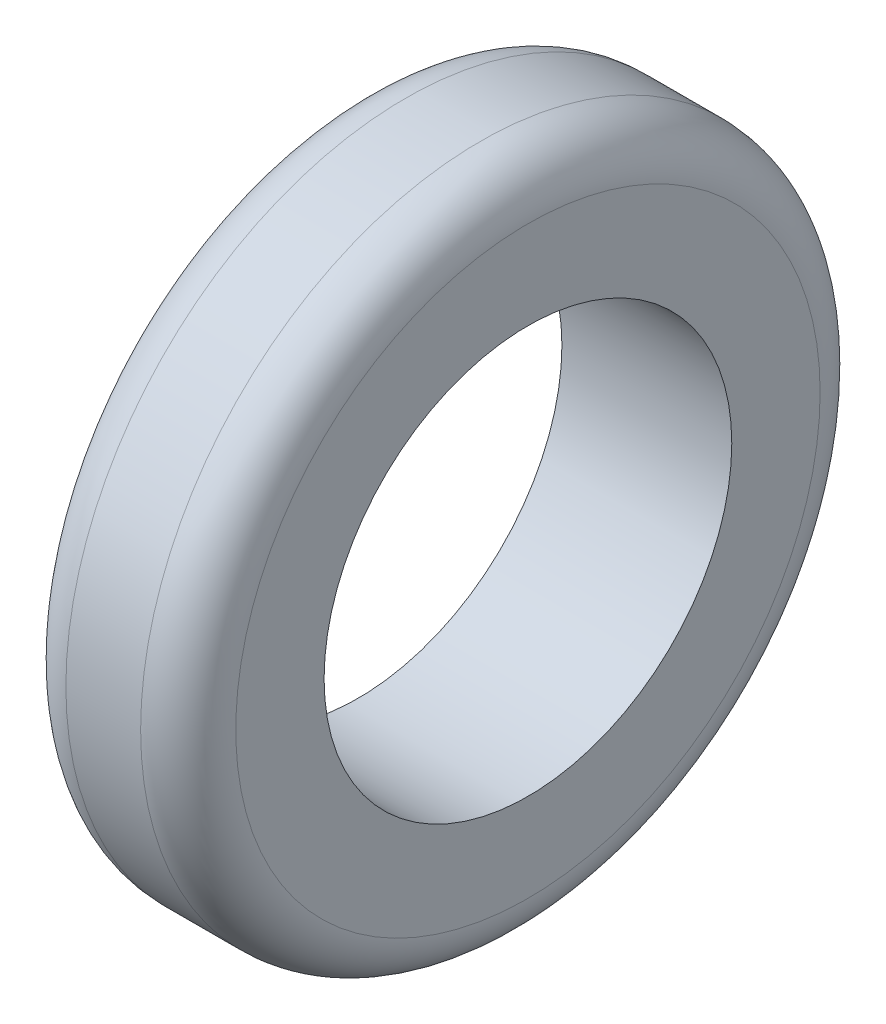
ISO-10303-21;
HEADER;
FILE_DESCRIPTION(('STEP AP214'),'2;1');
FILE_NAME('part.step','',(''),(''),'','','');
FILE_SCHEMA(('AUTOMOTIVE_DESIGN { 1 0 10303 214 1 1 1 1 }'));
ENDSEC;
DATA;
#1=APPLICATION_CONTEXT('core data for automotive mechanical design processes');
#2=APPLICATION_PROTOCOL_DEFINITION('international standard','automotive_design',2000,#1);
#3=PRODUCT_CONTEXT('',#1,'mechanical');
#4=PRODUCT('Part','Part','',(#3));
#5=PRODUCT_RELATED_PRODUCT_CATEGORY('part','',(#4));
#6=PRODUCT_DEFINITION_FORMATION('','',#4);
#7=PRODUCT_DEFINITION_CONTEXT('part definition',#1,'design');
#8=PRODUCT_DEFINITION('design','',#6,#7);
#9=PRODUCT_DEFINITION_SHAPE('','',#8);
#10=(LENGTH_UNIT() NAMED_UNIT(*) SI_UNIT(.MILLI.,.METRE.));
#11=(NAMED_UNIT(*) PLANE_ANGLE_UNIT() SI_UNIT($,.RADIAN.));
#12=(NAMED_UNIT(*) SI_UNIT($,.STERADIAN.) SOLID_ANGLE_UNIT());
#13=UNCERTAINTY_MEASURE_WITH_UNIT(LENGTH_MEASURE(1.E-05),#10,'distance_accuracy_value','');
#14=(GEOMETRIC_REPRESENTATION_CONTEXT(3) GLOBAL_UNCERTAINTY_ASSIGNED_CONTEXT((#13)) GLOBAL_UNIT_ASSIGNED_CONTEXT((#10,
#11,#12)) REPRESENTATION_CONTEXT('',''));
#15=CARTESIAN_POINT('',(0.,0.,0.));
#16=DIRECTION('',(0.,0.,1.));
#17=DIRECTION('',(1.,0.,0.));
#18=AXIS2_PLACEMENT_3D('',#15,#16,#17);
#19=CARTESIAN_POINT('',(25.,0.,0.));
#20=DIRECTION('',(1.,0.,0.));
#21=DIRECTION('',(0.,0.,-1.));
#22=AXIS2_PLACEMENT_3D('',#19,#20,#21);
#23=PLANE('',#22);
#24=CARTESIAN_POINT('',(25.,0.,0.));
#25=DIRECTION('',(1.,0.,0.));
#26=DIRECTION('',(0.,0.,-1.));
#27=AXIS2_PLACEMENT_3D('',#24,#25,#26);
#28=CIRCLE('',#27,43.);
#29=CARTESIAN_POINT('',(25.,0.,-43.));
#30=VERTEX_POINT('',#29);
#31=EDGE_CURVE('E10',#30,#30,#28,.T.);
#32=ORIENTED_EDGE('',*,*,#31,.T.);
#33=EDGE_LOOP('',(#32));
#34=FACE_BOUND('',#33,.T.);
#35=CARTESIAN_POINT('',(25.,0.,0.));
#36=DIRECTION('',(1.,0.,0.));
#37=DIRECTION('',(0.,0.,-1.));
#38=AXIS2_PLACEMENT_3D('',#35,#36,#37);
#39=CIRCLE('',#38,30.);
#40=CARTESIAN_POINT('',(25.,0.,-30.));
#41=VERTEX_POINT('',#40);
#42=EDGE_CURVE('E53',#41,#41,#39,.T.);
#43=ORIENTED_EDGE('',*,*,#42,.F.);
#44=EDGE_LOOP('',(#43));
#45=FACE_BOUND('',#44,.T.);
#46=ADVANCED_FACE('F33',(#34,#45),#23,.T.);
#47=CARTESIAN_POINT('',(0.,0.,0.));
#48=DIRECTION('',(1.,0.,0.));
#49=DIRECTION('',(0.,0.,-1.));
#50=AXIS2_PLACEMENT_3D('',#47,#48,#49);
#51=PLANE('',#50);
#52=CARTESIAN_POINT('',(0.,0.,0.));
#53=DIRECTION('',(1.,0.,0.));
#54=DIRECTION('',(0.,0.,-1.));
#55=AXIS2_PLACEMENT_3D('',#52,#53,#54);
#56=CIRCLE('',#55,43.);
#57=CARTESIAN_POINT('',(0.,0.,-43.));
#58=VERTEX_POINT('',#57);
#59=EDGE_CURVE('E40',#58,#58,#56,.F.);
#60=ORIENTED_EDGE('',*,*,#59,.T.);
#61=EDGE_LOOP('',(#60));
#62=FACE_BOUND('',#61,.T.);
#63=CARTESIAN_POINT('',(0.,0.,0.));
#64=DIRECTION('',(1.,0.,0.));
#65=DIRECTION('',(0.,0.,-1.));
#66=AXIS2_PLACEMENT_3D('',#63,#64,#65);
#67=CIRCLE('',#66,30.);
#68=CARTESIAN_POINT('',(0.,0.,-30.));
#69=VERTEX_POINT('',#68);
#70=EDGE_CURVE('E54',#69,#69,#67,.T.);
#71=ORIENTED_EDGE('',*,*,#70,.T.);
#72=EDGE_LOOP('',(#71));
#73=FACE_BOUND('',#72,.T.);
#74=ADVANCED_FACE('F64',(#62,#73),#51,.F.);
#75=CARTESIAN_POINT('',(25.,0.,0.));
#76=DIRECTION('',(-1.,0.,0.));
#77=DIRECTION('',(0.,0.,1.));
#78=AXIS2_PLACEMENT_3D('',#75,#76,#77);
#79=CYLINDRICAL_SURFACE('',#78,50.);
#80=CARTESIAN_POINT('',(7.,0.,0.));
#81=DIRECTION('',(1.,0.,0.));
#82=DIRECTION('',(0.,0.,-1.));
#83=AXIS2_PLACEMENT_3D('',#80,#81,#82);
#84=CIRCLE('',#83,50.);
#85=CARTESIAN_POINT('',(7.,0.,-50.));
#86=VERTEX_POINT('',#85);
#87=EDGE_CURVE('E44',#86,#86,#84,.T.);
#88=ORIENTED_EDGE('',*,*,#87,.T.);
#89=EDGE_LOOP('',(#88));
#90=FACE_BOUND('',#89,.T.);
#91=CARTESIAN_POINT('',(18.,0.,0.));
#92=DIRECTION('',(1.,0.,0.));
#93=DIRECTION('',(0.,0.,-1.));
#94=AXIS2_PLACEMENT_3D('',#91,#92,#93);
#95=CIRCLE('',#94,50.);
#96=CARTESIAN_POINT('',(18.,0.,-50.));
#97=VERTEX_POINT('',#96);
#98=EDGE_CURVE('E48',#97,#97,#95,.F.);
#99=ORIENTED_EDGE('',*,*,#98,.T.);
#100=EDGE_LOOP('',(#99));
#101=FACE_BOUND('',#100,.T.);
#102=ADVANCED_FACE('F69',(#90,#101),#79,.T.);
#103=CARTESIAN_POINT('',(25.,0.,0.));
#104=DIRECTION('',(-1.,0.,0.));
#105=DIRECTION('',(0.,0.,1.));
#106=AXIS2_PLACEMENT_3D('',#103,#104,#105);
#107=CYLINDRICAL_SURFACE('',#106,30.);
#108=ORIENTED_EDGE('',*,*,#42,.T.);
#109=EDGE_LOOP('',(#108));
#110=FACE_BOUND('',#109,.T.);
#111=ORIENTED_EDGE('',*,*,#70,.F.);
#112=EDGE_LOOP('',(#111));
#113=FACE_BOUND('',#112,.T.);
#114=ADVANCED_FACE('F60',(#110,#113),#107,.F.);
#115=CARTESIAN_POINT('',(7.,0.,0.));
#116=DIRECTION('',(1.,0.,0.));
#117=DIRECTION('',(0.,0.,-1.));
#118=AXIS2_PLACEMENT_3D('',#115,#116,#117);
#119=TOROIDAL_SURFACE('',#118,43.,7.);
#120=ORIENTED_EDGE('',*,*,#59,.F.);
#121=EDGE_LOOP('',(#120));
#122=FACE_BOUND('',#121,.T.);
#123=ORIENTED_EDGE('',*,*,#87,.F.);
#124=EDGE_LOOP('',(#123));
#125=FACE_BOUND('',#124,.T.);
#126=ADVANCED_FACE('F75',(#122,#125),#119,.T.);
#127=CARTESIAN_POINT('',(18.,0.,0.));
#128=DIRECTION('',(1.,0.,0.));
#129=DIRECTION('',(0.,0.,-1.));
#130=AXIS2_PLACEMENT_3D('',#127,#128,#129);
#131=TOROIDAL_SURFACE('',#130,43.,7.);
#132=ORIENTED_EDGE('',*,*,#98,.F.);
#133=EDGE_LOOP('',(#132));
#134=FACE_BOUND('',#133,.T.);
#135=ORIENTED_EDGE('',*,*,#31,.F.);
#136=EDGE_LOOP('',(#135));
#137=FACE_BOUND('',#136,.T.);
#138=ADVANCED_FACE('F35',(#134,#137),#131,.T.);
#139=CLOSED_SHELL('',(#46,#74,#102,#114,#126,#138));
#140=MANIFOLD_SOLID_BREP('B2',#139);
#141=ADVANCED_BREP_SHAPE_REPRESENTATION('',(#18,#140),#14);
#142=SHAPE_DEFINITION_REPRESENTATION(#9,#141);
ENDSEC;
END-ISO-10303-21;
